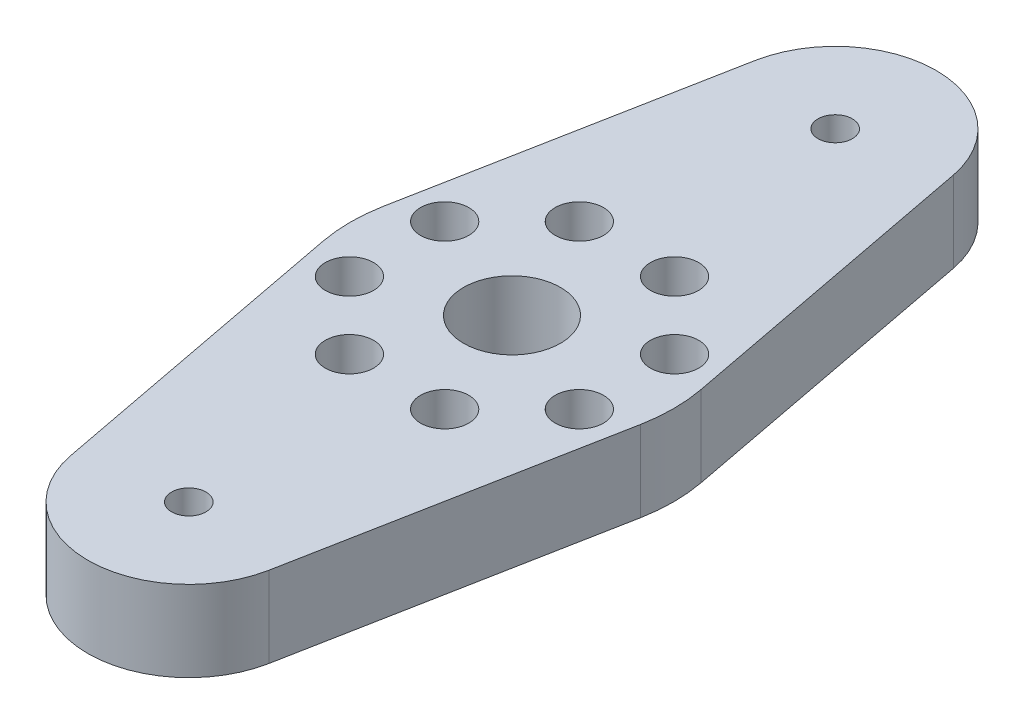
ISO-10303-21;
HEADER;
FILE_DESCRIPTION(('STEP AP214'),'2;1');
FILE_NAME('part.step','',(''),(''),'','','');
FILE_SCHEMA(('AUTOMOTIVE_DESIGN { 1 0 10303 214 1 1 1 1 }'));
ENDSEC;
DATA;
#1=APPLICATION_CONTEXT('core data for automotive mechanical design processes');
#2=APPLICATION_PROTOCOL_DEFINITION('international standard','automotive_design',2000,#1);
#3=PRODUCT_CONTEXT('',#1,'mechanical');
#4=PRODUCT('Part','Part','',(#3));
#5=PRODUCT_RELATED_PRODUCT_CATEGORY('part','',(#4));
#6=PRODUCT_DEFINITION_FORMATION('','',#4);
#7=PRODUCT_DEFINITION_CONTEXT('part definition',#1,'design');
#8=PRODUCT_DEFINITION('design','',#6,#7);
#9=PRODUCT_DEFINITION_SHAPE('','',#8);
#10=(LENGTH_UNIT() NAMED_UNIT(*) SI_UNIT(.MILLI.,.METRE.));
#11=(NAMED_UNIT(*) PLANE_ANGLE_UNIT() SI_UNIT($,.RADIAN.));
#12=(NAMED_UNIT(*) SI_UNIT($,.STERADIAN.) SOLID_ANGLE_UNIT());
#13=UNCERTAINTY_MEASURE_WITH_UNIT(LENGTH_MEASURE(1.E-05),#10,'distance_accuracy_value','');
#14=(GEOMETRIC_REPRESENTATION_CONTEXT(3) GLOBAL_UNCERTAINTY_ASSIGNED_CONTEXT((#13)) GLOBAL_UNIT_ASSIGNED_CONTEXT((#10,
#11,#12)) REPRESENTATION_CONTEXT('',''));
#15=CARTESIAN_POINT('',(0.,0.,0.));
#16=DIRECTION('',(0.,0.,1.));
#17=DIRECTION('',(1.,0.,0.));
#18=AXIS2_PLACEMENT_3D('',#15,#16,#17);
#19=CARTESIAN_POINT('',(0.,6.35,0.));
#20=DIRECTION('',(0.,1.,0.));
#21=DIRECTION('',(0.,0.,1.));
#22=AXIS2_PLACEMENT_3D('',#19,#20,#21);
#23=PLANE('',#22);
#24=CARTESIAN_POINT('',(-9.03461794842787,6.35,3.74226128509822));
#25=DIRECTION('',(0.,1.,0.));
#26=DIRECTION('',(0.,0.,1.));
#27=AXIS2_PLACEMENT_3D('',#24,#25,#26);
#28=CIRCLE('',#27,1.89865);
#29=CARTESIAN_POINT('',(-9.03461794842787,6.35,5.64091128509822));
#30=VERTEX_POINT('',#29);
#31=EDGE_CURVE('E254',#30,#30,#28,.T.);
#32=ORIENTED_EDGE('',*,*,#31,.F.);
#33=EDGE_LOOP('',(#32));
#34=FACE_BOUND('',#33,.T.);
#35=CARTESIAN_POINT('',(-9.0346179484279,6.35,-3.74226128509816));
#36=DIRECTION('',(0.,1.,0.));
#37=DIRECTION('',(0.,0.,1.));
#38=AXIS2_PLACEMENT_3D('',#35,#36,#37);
#39=CIRCLE('',#38,1.89865);
#40=CARTESIAN_POINT('',(-9.0346179484279,6.35,-1.84361128509816));
#41=VERTEX_POINT('',#40);
#42=EDGE_CURVE('E247',#41,#41,#39,.T.);
#43=ORIENTED_EDGE('',*,*,#42,.F.);
#44=EDGE_LOOP('',(#43));
#45=FACE_BOUND('',#44,.T.);
#46=CARTESIAN_POINT('',(9.03461794842787,6.35,-3.74226128509822));
#47=DIRECTION('',(0.,1.,0.));
#48=DIRECTION('',(0.,0.,1.));
#49=AXIS2_PLACEMENT_3D('',#46,#47,#48);
#50=CIRCLE('',#49,1.89865);
#51=CARTESIAN_POINT('',(9.03461794842787,6.35,-1.84361128509822));
#52=VERTEX_POINT('',#51);
#53=EDGE_CURVE('E237',#52,#52,#50,.T.);
#54=ORIENTED_EDGE('',*,*,#53,.F.);
#55=EDGE_LOOP('',(#54));
#56=FACE_BOUND('',#55,.T.);
#57=CARTESIAN_POINT('',(9.0346179484279,6.35,3.74226128509816));
#58=DIRECTION('',(0.,1.,0.));
#59=DIRECTION('',(0.,0.,1.));
#60=AXIS2_PLACEMENT_3D('',#57,#58,#59);
#61=CIRCLE('',#60,1.89865);
#62=CARTESIAN_POINT('',(9.0346179484279,6.35,5.64091128509816));
#63=VERTEX_POINT('',#62);
#64=EDGE_CURVE('E232',#63,#63,#61,.T.);
#65=ORIENTED_EDGE('',*,*,#64,.F.);
#66=EDGE_LOOP('',(#65));
#67=FACE_BOUND('',#66,.T.);
#68=CARTESIAN_POINT('',(-3.74226128509819,6.35,-9.03461794842788));
#69=DIRECTION('',(0.,1.,0.));
#70=DIRECTION('',(0.,0.,1.));
#71=AXIS2_PLACEMENT_3D('',#68,#69,#70);
#72=CIRCLE('',#71,1.89865);
#73=CARTESIAN_POINT('',(-3.74226128509819,6.35,-7.13596794842788));
#74=VERTEX_POINT('',#73);
#75=EDGE_CURVE('E225',#74,#74,#72,.T.);
#76=ORIENTED_EDGE('',*,*,#75,.F.);
#77=EDGE_LOOP('',(#76));
#78=FACE_BOUND('',#77,.T.);
#79=CARTESIAN_POINT('',(3.74226128509819,6.35,-9.03461794842788));
#80=DIRECTION('',(0.,1.,0.));
#81=DIRECTION('',(0.,0.,1.));
#82=AXIS2_PLACEMENT_3D('',#79,#80,#81);
#83=CIRCLE('',#82,1.89865);
#84=CARTESIAN_POINT('',(3.74226128509819,6.35,-7.13596794842788));
#85=VERTEX_POINT('',#84);
#86=EDGE_CURVE('E214',#85,#85,#83,.T.);
#87=ORIENTED_EDGE('',*,*,#86,.F.);
#88=EDGE_LOOP('',(#87));
#89=FACE_BOUND('',#88,.T.);
#90=CARTESIAN_POINT('',(3.74226128509819,6.35,9.03461794842788));
#91=DIRECTION('',(0.,1.,0.));
#92=DIRECTION('',(0.,0.,1.));
#93=AXIS2_PLACEMENT_3D('',#90,#91,#92);
#94=CIRCLE('',#93,1.89865);
#95=CARTESIAN_POINT('',(3.74226128509819,6.35,10.9332679484279));
#96=VERTEX_POINT('',#95);
#97=EDGE_CURVE('E206',#96,#96,#94,.T.);
#98=ORIENTED_EDGE('',*,*,#97,.F.);
#99=EDGE_LOOP('',(#98));
#100=FACE_BOUND('',#99,.T.);
#101=CARTESIAN_POINT('',(-3.74226128509819,6.35,9.03461794842788));
#102=DIRECTION('',(0.,1.,0.));
#103=DIRECTION('',(0.,0.,1.));
#104=AXIS2_PLACEMENT_3D('',#101,#102,#103);
#105=CIRCLE('',#104,1.89865);
#106=CARTESIAN_POINT('',(-3.74226128509819,6.35,10.9332679484279));
#107=VERTEX_POINT('',#106);
#108=EDGE_CURVE('E201',#107,#107,#105,.T.);
#109=ORIENTED_EDGE('',*,*,#108,.F.);
#110=EDGE_LOOP('',(#109));
#111=FACE_BOUND('',#110,.T.);
#112=CARTESIAN_POINT('',(0.,6.35,25.4));
#113=DIRECTION('',(0.,1.,0.));
#114=DIRECTION('',(0.,0.,1.));
#115=AXIS2_PLACEMENT_3D('',#112,#113,#114);
#116=CIRCLE('',#115,1.35254999999999);
#117=CARTESIAN_POINT('',(0.,6.35,26.75255));
#118=VERTEX_POINT('',#117);
#119=EDGE_CURVE('E190',#118,#118,#116,.T.);
#120=ORIENTED_EDGE('',*,*,#119,.F.);
#121=EDGE_LOOP('',(#120));
#122=FACE_BOUND('',#121,.T.);
#123=CARTESIAN_POINT('',(0.,6.35,-25.4));
#124=DIRECTION('',(0.,1.,0.));
#125=DIRECTION('',(0.,0.,1.));
#126=AXIS2_PLACEMENT_3D('',#123,#124,#125);
#127=CIRCLE('',#126,1.35254999999999);
#128=CARTESIAN_POINT('',(0.,6.35,-24.04745));
#129=VERTEX_POINT('',#128);
#130=EDGE_CURVE('E182',#129,#129,#127,.T.);
#131=ORIENTED_EDGE('',*,*,#130,.F.);
#132=EDGE_LOOP('',(#131));
#133=FACE_BOUND('',#132,.T.);
#134=CARTESIAN_POINT('',(0.,6.35,0.));
#135=DIRECTION('',(0.,1.,0.));
#136=DIRECTION('',(0.,0.,1.));
#137=AXIS2_PLACEMENT_3D('',#134,#135,#136);
#138=CIRCLE('',#137,12.7);
#139=CARTESIAN_POINT('',(-12.474760456117,6.35,-2.38124999999999));
#140=VERTEX_POINT('',#139);
#141=CARTESIAN_POINT('',(-12.474760456117,6.35,2.38125));
#142=VERTEX_POINT('',#141);
#143=EDGE_CURVE('E168',#140,#142,#138,.T.);
#144=ORIENTED_EDGE('',*,*,#143,.T.);
#145=DIRECTION('',(0.1875,0.,0.982264602843857));
#146=VECTOR('',#145,1.);
#147=CARTESIAN_POINT('',(-12.474760456117,6.35,2.38125));
#148=LINE('',#147,#146);
#149=CARTESIAN_POINT('',(-7.79672528507312,6.35,26.88828125));
#150=VERTEX_POINT('',#149);
#151=EDGE_CURVE('E102',#142,#150,#148,.T.);
#152=ORIENTED_EDGE('',*,*,#151,.T.);
#153=CARTESIAN_POINT('',(0.,6.35,25.4));
#154=DIRECTION('',(0.,1.,0.));
#155=DIRECTION('',(0.,0.,1.));
#156=AXIS2_PLACEMENT_3D('',#153,#154,#155);
#157=CIRCLE('',#156,7.9375);
#158=CARTESIAN_POINT('',(7.79672528507311,6.35,26.88828125));
#159=VERTEX_POINT('',#158);
#160=EDGE_CURVE('E157',#150,#159,#157,.T.);
#161=ORIENTED_EDGE('',*,*,#160,.T.);
#162=DIRECTION('',(0.1875,0.,-0.982264602843857));
#163=VECTOR('',#162,1.);
#164=CARTESIAN_POINT('',(12.474760456117,6.35,2.38125));
#165=LINE('',#164,#163);
#166=CARTESIAN_POINT('',(12.474760456117,6.35,2.38125));
#167=VERTEX_POINT('',#166);
#168=EDGE_CURVE('E153',#159,#167,#165,.T.);
#169=ORIENTED_EDGE('',*,*,#168,.T.);
#170=CARTESIAN_POINT('',(0.,6.35,0.));
#171=DIRECTION('',(0.,1.,0.));
#172=DIRECTION('',(0.,0.,1.));
#173=AXIS2_PLACEMENT_3D('',#170,#171,#172);
#174=CIRCLE('',#173,12.7);
#175=CARTESIAN_POINT('',(12.474760456117,6.35,-2.38125));
#176=VERTEX_POINT('',#175);
#177=EDGE_CURVE('E121',#167,#176,#174,.T.);
#178=ORIENTED_EDGE('',*,*,#177,.T.);
#179=DIRECTION('',(-0.1875,0.,-0.982264602843857));
#180=VECTOR('',#179,1.);
#181=CARTESIAN_POINT('',(7.7967252850731,6.35,-26.88828125));
#182=LINE('',#181,#180);
#183=CARTESIAN_POINT('',(7.79672528507311,6.35,-26.88828125));
#184=VERTEX_POINT('',#183);
#185=EDGE_CURVE('E115',#176,#184,#182,.T.);
#186=ORIENTED_EDGE('',*,*,#185,.T.);
#187=CARTESIAN_POINT('',(0.,6.35,-25.4));
#188=DIRECTION('',(0.,1.,0.));
#189=DIRECTION('',(0.,0.,1.));
#190=AXIS2_PLACEMENT_3D('',#187,#188,#189);
#191=CIRCLE('',#190,7.9375);
#192=CARTESIAN_POINT('',(-7.79672528507313,6.35,-26.88828125));
#193=VERTEX_POINT('',#192);
#194=EDGE_CURVE('E119',#184,#193,#191,.T.);
#195=ORIENTED_EDGE('',*,*,#194,.T.);
#196=DIRECTION('',(-0.187499999999999,0.,0.982264602843857));
#197=VECTOR('',#196,1.);
#198=CARTESIAN_POINT('',(-12.474760456117,6.35,-2.38124999999999));
#199=LINE('',#198,#197);
#200=EDGE_CURVE('E59',#193,#140,#199,.T.);
#201=ORIENTED_EDGE('',*,*,#200,.T.);
#202=EDGE_LOOP('',(#144,#152,#161,#169,#178,#186,#195,#201));
#203=FACE_BOUND('',#202,.T.);
#204=CARTESIAN_POINT('',(0.,6.35,0.));
#205=DIRECTION('',(0.,1.,0.));
#206=DIRECTION('',(0.,0.,1.));
#207=AXIS2_PLACEMENT_3D('',#204,#205,#206);
#208=CIRCLE('',#207,3.81);
#209=CARTESIAN_POINT('',(0.,6.35,3.81));
#210=VERTEX_POINT('',#209);
#211=EDGE_CURVE('E174',#210,#210,#208,.T.);
#212=ORIENTED_EDGE('',*,*,#211,.F.);
#213=EDGE_LOOP('',(#212));
#214=FACE_BOUND('',#213,.T.);
#215=ADVANCED_FACE('F40',(#34,#45,#56,#67,#78,#89,#100,#111,#122,#133,#203,#214),#23,.T.);
#216=CARTESIAN_POINT('',(0.,0.,0.));
#217=DIRECTION('',(0.,1.,0.));
#218=DIRECTION('',(0.,0.,1.));
#219=AXIS2_PLACEMENT_3D('',#216,#217,#218);
#220=PLANE('',#219);
#221=CARTESIAN_POINT('',(-9.03461794842787,0.,3.74226128509822));
#222=DIRECTION('',(0.,1.,0.));
#223=DIRECTION('',(0.,0.,1.));
#224=AXIS2_PLACEMENT_3D('',#221,#222,#223);
#225=CIRCLE('',#224,1.89865);
#226=CARTESIAN_POINT('',(-9.03461794842787,0.,5.64091128509822));
#227=VERTEX_POINT('',#226);
#228=EDGE_CURVE('E252',#227,#227,#225,.T.);
#229=ORIENTED_EDGE('',*,*,#228,.T.);
#230=EDGE_LOOP('',(#229));
#231=FACE_BOUND('',#230,.T.);
#232=CARTESIAN_POINT('',(-9.0346179484279,0.,-3.74226128509816));
#233=DIRECTION('',(0.,1.,0.));
#234=DIRECTION('',(0.,0.,1.));
#235=AXIS2_PLACEMENT_3D('',#232,#233,#234);
#236=CIRCLE('',#235,1.89865);
#237=CARTESIAN_POINT('',(-9.0346179484279,0.,-1.84361128509816));
#238=VERTEX_POINT('',#237);
#239=EDGE_CURVE('E242',#238,#238,#236,.T.);
#240=ORIENTED_EDGE('',*,*,#239,.T.);
#241=EDGE_LOOP('',(#240));
#242=FACE_BOUND('',#241,.T.);
#243=CARTESIAN_POINT('',(9.03461794842787,0.,-3.74226128509822));
#244=DIRECTION('',(0.,1.,0.));
#245=DIRECTION('',(0.,0.,1.));
#246=AXIS2_PLACEMENT_3D('',#243,#244,#245);
#247=CIRCLE('',#246,1.89865);
#248=CARTESIAN_POINT('',(9.03461794842787,0.,-1.84361128509822));
#249=VERTEX_POINT('',#248);
#250=EDGE_CURVE('E44',#249,#249,#247,.T.);
#251=ORIENTED_EDGE('',*,*,#250,.T.);
#252=EDGE_LOOP('',(#251));
#253=FACE_BOUND('',#252,.T.);
#254=CARTESIAN_POINT('',(9.0346179484279,0.,3.74226128509816));
#255=DIRECTION('',(0.,1.,0.));
#256=DIRECTION('',(0.,0.,1.));
#257=AXIS2_PLACEMENT_3D('',#254,#255,#256);
#258=CIRCLE('',#257,1.89865);
#259=CARTESIAN_POINT('',(9.0346179484279,0.,5.64091128509816));
#260=VERTEX_POINT('',#259);
#261=EDGE_CURVE('E230',#260,#260,#258,.T.);
#262=ORIENTED_EDGE('',*,*,#261,.T.);
#263=EDGE_LOOP('',(#262));
#264=FACE_BOUND('',#263,.T.);
#265=CARTESIAN_POINT('',(-3.74226128509819,0.,-9.03461794842788));
#266=DIRECTION('',(0.,1.,0.));
#267=DIRECTION('',(0.,0.,1.));
#268=AXIS2_PLACEMENT_3D('',#265,#266,#267);
#269=CIRCLE('',#268,1.89865);
#270=CARTESIAN_POINT('',(-3.74226128509819,0.,-7.13596794842788));
#271=VERTEX_POINT('',#270);
#272=EDGE_CURVE('E219',#271,#271,#269,.T.);
#273=ORIENTED_EDGE('',*,*,#272,.T.);
#274=EDGE_LOOP('',(#273));
#275=FACE_BOUND('',#274,.T.);
#276=CARTESIAN_POINT('',(3.74226128509819,0.,-9.03461794842788));
#277=DIRECTION('',(0.,1.,0.));
#278=DIRECTION('',(0.,0.,1.));
#279=AXIS2_PLACEMENT_3D('',#276,#277,#278);
#280=CIRCLE('',#279,1.89865);
#281=CARTESIAN_POINT('',(3.74226128509819,0.,-7.13596794842788));
#282=VERTEX_POINT('',#281);
#283=EDGE_CURVE('E211',#282,#282,#280,.T.);
#284=ORIENTED_EDGE('',*,*,#283,.T.);
#285=EDGE_LOOP('',(#284));
#286=FACE_BOUND('',#285,.T.);
#287=CARTESIAN_POINT('',(3.74226128509819,0.,9.03461794842788));
#288=DIRECTION('',(0.,1.,0.));
#289=DIRECTION('',(0.,0.,1.));
#290=AXIS2_PLACEMENT_3D('',#287,#288,#289);
#291=CIRCLE('',#290,1.89865);
#292=CARTESIAN_POINT('',(3.74226128509819,0.,10.9332679484279));
#293=VERTEX_POINT('',#292);
#294=EDGE_CURVE('E205',#293,#293,#291,.T.);
#295=ORIENTED_EDGE('',*,*,#294,.T.);
#296=EDGE_LOOP('',(#295));
#297=FACE_BOUND('',#296,.T.);
#298=CARTESIAN_POINT('',(-3.74226128509819,0.,9.03461794842788));
#299=DIRECTION('',(0.,1.,0.));
#300=DIRECTION('',(0.,0.,1.));
#301=AXIS2_PLACEMENT_3D('',#298,#299,#300);
#302=CIRCLE('',#301,1.89865);
#303=CARTESIAN_POINT('',(-3.74226128509819,0.,10.9332679484279));
#304=VERTEX_POINT('',#303);
#305=EDGE_CURVE('E195',#304,#304,#302,.T.);
#306=ORIENTED_EDGE('',*,*,#305,.T.);
#307=EDGE_LOOP('',(#306));
#308=FACE_BOUND('',#307,.T.);
#309=CARTESIAN_POINT('',(0.,0.,25.4));
#310=DIRECTION('',(0.,1.,0.));
#311=DIRECTION('',(0.,0.,1.));
#312=AXIS2_PLACEMENT_3D('',#309,#310,#311);
#313=CIRCLE('',#312,1.35254999999999);
#314=CARTESIAN_POINT('',(0.,0.,26.75255));
#315=VERTEX_POINT('',#314);
#316=EDGE_CURVE('E187',#315,#315,#313,.T.);
#317=ORIENTED_EDGE('',*,*,#316,.T.);
#318=EDGE_LOOP('',(#317));
#319=FACE_BOUND('',#318,.T.);
#320=CARTESIAN_POINT('',(0.,0.,-25.4));
#321=DIRECTION('',(0.,1.,0.));
#322=DIRECTION('',(0.,0.,1.));
#323=AXIS2_PLACEMENT_3D('',#320,#321,#322);
#324=CIRCLE('',#323,1.35254999999999);
#325=CARTESIAN_POINT('',(0.,0.,-24.04745));
#326=VERTEX_POINT('',#325);
#327=EDGE_CURVE('E175',#326,#326,#324,.T.);
#328=ORIENTED_EDGE('',*,*,#327,.T.);
#329=EDGE_LOOP('',(#328));
#330=FACE_BOUND('',#329,.T.);
#331=CARTESIAN_POINT('',(0.,0.,0.));
#332=DIRECTION('',(0.,1.,0.));
#333=DIRECTION('',(0.,0.,1.));
#334=AXIS2_PLACEMENT_3D('',#331,#332,#333);
#335=CIRCLE('',#334,12.7);
#336=CARTESIAN_POINT('',(-12.474760456117,0.,-2.38124999999999));
#337=VERTEX_POINT('',#336);
#338=CARTESIAN_POINT('',(-12.474760456117,0.,2.38125));
#339=VERTEX_POINT('',#338);
#340=EDGE_CURVE('E180',#337,#339,#335,.T.);
#341=ORIENTED_EDGE('',*,*,#340,.F.);
#342=DIRECTION('',(-0.187499999999999,0.,0.982264602843857));
#343=VECTOR('',#342,1.);
#344=CARTESIAN_POINT('',(-12.474760456117,0.,-2.38124999999999));
#345=LINE('',#344,#343);
#346=CARTESIAN_POINT('',(-7.79672528507313,0.,-26.88828125));
#347=VERTEX_POINT('',#346);
#348=EDGE_CURVE('E94',#347,#337,#345,.T.);
#349=ORIENTED_EDGE('',*,*,#348,.F.);
#350=CARTESIAN_POINT('',(0.,0.,-25.4));
#351=DIRECTION('',(0.,1.,0.));
#352=DIRECTION('',(0.,0.,1.));
#353=AXIS2_PLACEMENT_3D('',#350,#351,#352);
#354=CIRCLE('',#353,7.9375);
#355=CARTESIAN_POINT('',(7.79672528507311,0.,-26.88828125));
#356=VERTEX_POINT('',#355);
#357=EDGE_CURVE('E88',#356,#347,#354,.T.);
#358=ORIENTED_EDGE('',*,*,#357,.F.);
#359=DIRECTION('',(-0.1875,0.,-0.982264602843857));
#360=VECTOR('',#359,1.);
#361=CARTESIAN_POINT('',(7.7967252850731,0.,-26.88828125));
#362=LINE('',#361,#360);
#363=CARTESIAN_POINT('',(12.474760456117,0.,-2.38125));
#364=VERTEX_POINT('',#363);
#365=EDGE_CURVE('E130',#364,#356,#362,.T.);
#366=ORIENTED_EDGE('',*,*,#365,.F.);
#367=CARTESIAN_POINT('',(0.,0.,0.));
#368=DIRECTION('',(0.,1.,0.));
#369=DIRECTION('',(0.,0.,1.));
#370=AXIS2_PLACEMENT_3D('',#367,#368,#369);
#371=CIRCLE('',#370,12.7);
#372=CARTESIAN_POINT('',(12.474760456117,0.,2.38125));
#373=VERTEX_POINT('',#372);
#374=EDGE_CURVE('E349',#373,#364,#371,.T.);
#375=ORIENTED_EDGE('',*,*,#374,.F.);
#376=DIRECTION('',(0.1875,0.,-0.982264602843857));
#377=VECTOR('',#376,1.);
#378=CARTESIAN_POINT('',(12.474760456117,0.,2.38125));
#379=LINE('',#378,#377);
#380=CARTESIAN_POINT('',(7.79672528507311,0.,26.88828125));
#381=VERTEX_POINT('',#380);
#382=EDGE_CURVE('E347',#381,#373,#379,.T.);
#383=ORIENTED_EDGE('',*,*,#382,.F.);
#384=CARTESIAN_POINT('',(0.,0.,25.4));
#385=DIRECTION('',(0.,1.,0.));
#386=DIRECTION('',(0.,0.,1.));
#387=AXIS2_PLACEMENT_3D('',#384,#385,#386);
#388=CIRCLE('',#387,7.9375);
#389=CARTESIAN_POINT('',(-7.79672528507312,0.,26.88828125));
#390=VERTEX_POINT('',#389);
#391=EDGE_CURVE('E338',#390,#381,#388,.T.);
#392=ORIENTED_EDGE('',*,*,#391,.F.);
#393=DIRECTION('',(0.1875,0.,0.982264602843857));
#394=VECTOR('',#393,1.);
#395=CARTESIAN_POINT('',(-12.474760456117,0.,2.38125));
#396=LINE('',#395,#394);
#397=EDGE_CURVE('E330',#339,#390,#396,.T.);
#398=ORIENTED_EDGE('',*,*,#397,.F.);
#399=EDGE_LOOP('',(#341,#349,#358,#366,#375,#383,#392,#398));
#400=FACE_BOUND('',#399,.T.);
#401=CARTESIAN_POINT('',(0.,0.,0.));
#402=DIRECTION('',(0.,1.,0.));
#403=DIRECTION('',(0.,0.,1.));
#404=AXIS2_PLACEMENT_3D('',#401,#402,#403);
#405=CIRCLE('',#404,3.81);
#406=CARTESIAN_POINT('',(0.,0.,3.81));
#407=VERTEX_POINT('',#406);
#408=EDGE_CURVE('E172',#407,#407,#405,.T.);
#409=ORIENTED_EDGE('',*,*,#408,.T.);
#410=EDGE_LOOP('',(#409));
#411=FACE_BOUND('',#410,.T.);
#412=ADVANCED_FACE('F265',(#231,#242,#253,#264,#275,#286,#297,#308,#319,#330,#400,#411),#220,.F.);
#413=CARTESIAN_POINT('',(0.,6.35,0.));
#414=DIRECTION('',(0.,-1.,0.));
#415=DIRECTION('',(0.,0.,-1.));
#416=AXIS2_PLACEMENT_3D('',#413,#414,#415);
#417=CYLINDRICAL_SURFACE('',#416,12.7);
#418=ORIENTED_EDGE('',*,*,#340,.T.);
#419=DIRECTION('',(0.,-1.,0.));
#420=VECTOR('',#419,1.);
#421=CARTESIAN_POINT('',(-12.474760456117,6.35,2.38125));
#422=LINE('',#421,#420);
#423=EDGE_CURVE('E12',#142,#339,#422,.T.);
#424=ORIENTED_EDGE('',*,*,#423,.F.);
#425=ORIENTED_EDGE('',*,*,#143,.F.);
#426=DIRECTION('',(0.,-1.,0.));
#427=VECTOR('',#426,1.);
#428=CARTESIAN_POINT('',(-12.474760456117,6.35,-2.38124999999999));
#429=LINE('',#428,#427);
#430=EDGE_CURVE('E138',#140,#337,#429,.T.);
#431=ORIENTED_EDGE('',*,*,#430,.T.);
#432=EDGE_LOOP('',(#418,#424,#425,#431));
#433=FACE_BOUND('',#432,.T.);
#434=ADVANCED_FACE('F42',(#433),#417,.T.);
#435=CARTESIAN_POINT('',(-12.474760456117,6.35,2.38125));
#436=DIRECTION('',(0.982264602843857,0.,-0.1875));
#437=DIRECTION('',(-0.1875,0.,-0.982264602843857));
#438=AXIS2_PLACEMENT_3D('',#435,#436,#437);
#439=PLANE('',#438);
#440=ORIENTED_EDGE('',*,*,#397,.T.);
#441=DIRECTION('',(0.,-1.,0.));
#442=VECTOR('',#441,1.);
#443=CARTESIAN_POINT('',(-7.79672528507312,6.35,26.88828125));
#444=LINE('',#443,#442);
#445=EDGE_CURVE('E50',#150,#390,#444,.T.);
#446=ORIENTED_EDGE('',*,*,#445,.F.);
#447=ORIENTED_EDGE('',*,*,#151,.F.);
#448=ORIENTED_EDGE('',*,*,#423,.T.);
#449=EDGE_LOOP('',(#440,#446,#447,#448));
#450=FACE_BOUND('',#449,.T.);
#451=ADVANCED_FACE('F323',(#450),#439,.F.);
#452=CARTESIAN_POINT('',(0.,6.35,25.4));
#453=DIRECTION('',(0.,-1.,0.));
#454=DIRECTION('',(0.,0.,-1.));
#455=AXIS2_PLACEMENT_3D('',#452,#453,#454);
#456=CYLINDRICAL_SURFACE('',#455,7.9375);
#457=ORIENTED_EDGE('',*,*,#391,.T.);
#458=DIRECTION('',(0.,-1.,0.));
#459=VECTOR('',#458,1.);
#460=CARTESIAN_POINT('',(7.79672528507311,6.35,26.88828125));
#461=LINE('',#460,#459);
#462=EDGE_CURVE('E342',#159,#381,#461,.T.);
#463=ORIENTED_EDGE('',*,*,#462,.F.);
#464=ORIENTED_EDGE('',*,*,#160,.F.);
#465=ORIENTED_EDGE('',*,*,#445,.T.);
#466=EDGE_LOOP('',(#457,#463,#464,#465));
#467=FACE_BOUND('',#466,.T.);
#468=ADVANCED_FACE('F320',(#467),#456,.T.);
#469=CARTESIAN_POINT('',(12.474760456117,6.35,2.38125));
#470=DIRECTION('',(-0.982264602843857,0.,-0.1875));
#471=DIRECTION('',(-0.1875,0.,0.982264602843857));
#472=AXIS2_PLACEMENT_3D('',#469,#470,#471);
#473=PLANE('',#472);
#474=ORIENTED_EDGE('',*,*,#382,.T.);
#475=DIRECTION('',(0.,-1.,0.));
#476=VECTOR('',#475,1.);
#477=CARTESIAN_POINT('',(12.474760456117,6.35,2.38125));
#478=LINE('',#477,#476);
#479=EDGE_CURVE('E359',#167,#373,#478,.T.);
#480=ORIENTED_EDGE('',*,*,#479,.F.);
#481=ORIENTED_EDGE('',*,*,#168,.F.);
#482=ORIENTED_EDGE('',*,*,#462,.T.);
#483=EDGE_LOOP('',(#474,#480,#481,#482));
#484=FACE_BOUND('',#483,.T.);
#485=ADVANCED_FACE('F316',(#484),#473,.F.);
#486=CARTESIAN_POINT('',(0.,6.35,0.));
#487=DIRECTION('',(0.,-1.,0.));
#488=DIRECTION('',(0.,0.,-1.));
#489=AXIS2_PLACEMENT_3D('',#486,#487,#488);
#490=CYLINDRICAL_SURFACE('',#489,12.7);
#491=ORIENTED_EDGE('',*,*,#374,.T.);
#492=DIRECTION('',(0.,-1.,0.));
#493=VECTOR('',#492,1.);
#494=CARTESIAN_POINT('',(12.474760456117,6.35,-2.38125));
#495=LINE('',#494,#493);
#496=EDGE_CURVE('E131',#176,#364,#495,.T.);
#497=ORIENTED_EDGE('',*,*,#496,.F.);
#498=ORIENTED_EDGE('',*,*,#177,.F.);
#499=ORIENTED_EDGE('',*,*,#479,.T.);
#500=EDGE_LOOP('',(#491,#497,#498,#499));
#501=FACE_BOUND('',#500,.T.);
#502=ADVANCED_FACE('F313',(#501),#490,.T.);
#503=CARTESIAN_POINT('',(7.7967252850731,6.35,-26.88828125));
#504=DIRECTION('',(-0.982264602843857,0.,0.1875));
#505=DIRECTION('',(0.1875,0.,0.982264602843857));
#506=AXIS2_PLACEMENT_3D('',#503,#504,#505);
#507=PLANE('',#506);
#508=ORIENTED_EDGE('',*,*,#365,.T.);
#509=DIRECTION('',(0.,-1.,0.));
#510=VECTOR('',#509,1.);
#511=CARTESIAN_POINT('',(7.79672528507311,6.35,-26.88828125));
#512=LINE('',#511,#510);
#513=EDGE_CURVE('E127',#184,#356,#512,.T.);
#514=ORIENTED_EDGE('',*,*,#513,.F.);
#515=ORIENTED_EDGE('',*,*,#185,.F.);
#516=ORIENTED_EDGE('',*,*,#496,.T.);
#517=EDGE_LOOP('',(#508,#514,#515,#516));
#518=FACE_BOUND('',#517,.T.);
#519=ADVANCED_FACE('F128',(#518),#507,.F.);
#520=CARTESIAN_POINT('',(0.,6.35,-25.4));
#521=DIRECTION('',(0.,-1.,0.));
#522=DIRECTION('',(0.,0.,-1.));
#523=AXIS2_PLACEMENT_3D('',#520,#521,#522);
#524=CYLINDRICAL_SURFACE('',#523,7.9375);
#525=ORIENTED_EDGE('',*,*,#357,.T.);
#526=DIRECTION('',(0.,-1.,0.));
#527=VECTOR('',#526,1.);
#528=CARTESIAN_POINT('',(-7.79672528507313,6.35,-26.88828125));
#529=LINE('',#528,#527);
#530=EDGE_CURVE('E132',#193,#347,#529,.T.);
#531=ORIENTED_EDGE('',*,*,#530,.F.);
#532=ORIENTED_EDGE('',*,*,#194,.F.);
#533=ORIENTED_EDGE('',*,*,#513,.T.);
#534=EDGE_LOOP('',(#525,#531,#532,#533));
#535=FACE_BOUND('',#534,.T.);
#536=ADVANCED_FACE('F134',(#535),#524,.T.);
#537=CARTESIAN_POINT('',(-12.474760456117,6.35,-2.38124999999999));
#538=DIRECTION('',(0.982264602843857,0.,0.187499999999999));
#539=DIRECTION('',(0.187499999999999,0.,-0.982264602843857));
#540=AXIS2_PLACEMENT_3D('',#537,#538,#539);
#541=PLANE('',#540);
#542=ORIENTED_EDGE('',*,*,#348,.T.);
#543=ORIENTED_EDGE('',*,*,#430,.F.);
#544=ORIENTED_EDGE('',*,*,#200,.F.);
#545=ORIENTED_EDGE('',*,*,#530,.T.);
#546=EDGE_LOOP('',(#542,#543,#544,#545));
#547=FACE_BOUND('',#546,.T.);
#548=ADVANCED_FACE('F298',(#547),#541,.F.);
#549=CARTESIAN_POINT('',(0.,6.35,0.));
#550=DIRECTION('',(0.,-1.,0.));
#551=DIRECTION('',(0.,0.,-1.));
#552=AXIS2_PLACEMENT_3D('',#549,#550,#551);
#553=CYLINDRICAL_SURFACE('',#552,3.81);
#554=ORIENTED_EDGE('',*,*,#211,.T.);
#555=EDGE_LOOP('',(#554));
#556=FACE_BOUND('',#555,.T.);
#557=ORIENTED_EDGE('',*,*,#408,.F.);
#558=EDGE_LOOP('',(#557));
#559=FACE_BOUND('',#558,.T.);
#560=ADVANCED_FACE('F288',(#556,#559),#553,.F.);
#561=CARTESIAN_POINT('',(0.,6.35,-25.4));
#562=DIRECTION('',(0.,1.,0.));
#563=DIRECTION('',(0.,0.,1.));
#564=AXIS2_PLACEMENT_3D('',#561,#562,#563);
#565=CYLINDRICAL_SURFACE('',#564,1.35254999999999);
#566=ORIENTED_EDGE('',*,*,#327,.F.);
#567=EDGE_LOOP('',(#566));
#568=FACE_BOUND('',#567,.T.);
#569=ORIENTED_EDGE('',*,*,#130,.T.);
#570=EDGE_LOOP('',(#569));
#571=FACE_BOUND('',#570,.T.);
#572=ADVANCED_FACE('F285',(#568,#571),#565,.F.);
#573=CARTESIAN_POINT('',(0.,6.35,25.4));
#574=DIRECTION('',(0.,1.,0.));
#575=DIRECTION('',(0.,0.,1.));
#576=AXIS2_PLACEMENT_3D('',#573,#574,#575);
#577=CYLINDRICAL_SURFACE('',#576,1.35254999999999);
#578=ORIENTED_EDGE('',*,*,#316,.F.);
#579=EDGE_LOOP('',(#578));
#580=FACE_BOUND('',#579,.T.);
#581=ORIENTED_EDGE('',*,*,#119,.T.);
#582=EDGE_LOOP('',(#581));
#583=FACE_BOUND('',#582,.T.);
#584=ADVANCED_FACE('F287',(#580,#583),#577,.F.);
#585=CARTESIAN_POINT('',(-3.74226128509819,6.35,9.03461794842788));
#586=DIRECTION('',(0.,1.,0.));
#587=DIRECTION('',(0.,0.,1.));
#588=AXIS2_PLACEMENT_3D('',#585,#586,#587);
#589=CYLINDRICAL_SURFACE('',#588,1.89865);
#590=ORIENTED_EDGE('',*,*,#108,.T.);
#591=EDGE_LOOP('',(#590));
#592=FACE_BOUND('',#591,.T.);
#593=ORIENTED_EDGE('',*,*,#305,.F.);
#594=EDGE_LOOP('',(#593));
#595=FACE_BOUND('',#594,.T.);
#596=ADVANCED_FACE('F295',(#592,#595),#589,.F.);
#597=CARTESIAN_POINT('',(3.74226128509819,6.35,9.03461794842788));
#598=DIRECTION('',(0.,1.,0.));
#599=DIRECTION('',(0.,0.,1.));
#600=AXIS2_PLACEMENT_3D('',#597,#598,#599);
#601=CYLINDRICAL_SURFACE('',#600,1.89865);
#602=ORIENTED_EDGE('',*,*,#97,.T.);
#603=EDGE_LOOP('',(#602));
#604=FACE_BOUND('',#603,.T.);
#605=ORIENTED_EDGE('',*,*,#294,.F.);
#606=EDGE_LOOP('',(#605));
#607=FACE_BOUND('',#606,.T.);
#608=ADVANCED_FACE('F367',(#604,#607),#601,.F.);
#609=CARTESIAN_POINT('',(3.74226128509819,6.35,-9.03461794842788));
#610=DIRECTION('',(0.,1.,0.));
#611=DIRECTION('',(0.,0.,1.));
#612=AXIS2_PLACEMENT_3D('',#609,#610,#611);
#613=CYLINDRICAL_SURFACE('',#612,1.89865);
#614=ORIENTED_EDGE('',*,*,#86,.T.);
#615=EDGE_LOOP('',(#614));
#616=FACE_BOUND('',#615,.T.);
#617=ORIENTED_EDGE('',*,*,#283,.F.);
#618=EDGE_LOOP('',(#617));
#619=FACE_BOUND('',#618,.T.);
#620=ADVANCED_FACE('F369',(#616,#619),#613,.F.);
#621=CARTESIAN_POINT('',(-3.74226128509819,6.35,-9.03461794842788));
#622=DIRECTION('',(0.,1.,0.));
#623=DIRECTION('',(0.,0.,1.));
#624=AXIS2_PLACEMENT_3D('',#621,#622,#623);
#625=CYLINDRICAL_SURFACE('',#624,1.89865);
#626=ORIENTED_EDGE('',*,*,#75,.T.);
#627=EDGE_LOOP('',(#626));
#628=FACE_BOUND('',#627,.T.);
#629=ORIENTED_EDGE('',*,*,#272,.F.);
#630=EDGE_LOOP('',(#629));
#631=FACE_BOUND('',#630,.T.);
#632=ADVANCED_FACE('F376',(#628,#631),#625,.F.);
#633=CARTESIAN_POINT('',(9.0346179484279,6.35,3.74226128509816));
#634=DIRECTION('',(0.,1.,0.));
#635=DIRECTION('',(0.,0.,1.));
#636=AXIS2_PLACEMENT_3D('',#633,#634,#635);
#637=CYLINDRICAL_SURFACE('',#636,1.89865);
#638=ORIENTED_EDGE('',*,*,#64,.T.);
#639=EDGE_LOOP('',(#638));
#640=FACE_BOUND('',#639,.T.);
#641=ORIENTED_EDGE('',*,*,#261,.F.);
#642=EDGE_LOOP('',(#641));
#643=FACE_BOUND('',#642,.T.);
#644=ADVANCED_FACE('F383',(#640,#643),#637,.F.);
#645=CARTESIAN_POINT('',(9.03461794842787,6.35,-3.74226128509822));
#646=DIRECTION('',(0.,1.,0.));
#647=DIRECTION('',(0.,0.,1.));
#648=AXIS2_PLACEMENT_3D('',#645,#646,#647);
#649=CYLINDRICAL_SURFACE('',#648,1.89865);
#650=ORIENTED_EDGE('',*,*,#53,.T.);
#651=EDGE_LOOP('',(#650));
#652=FACE_BOUND('',#651,.T.);
#653=ORIENTED_EDGE('',*,*,#250,.F.);
#654=EDGE_LOOP('',(#653));
#655=FACE_BOUND('',#654,.T.);
#656=ADVANCED_FACE('F387',(#652,#655),#649,.F.);
#657=CARTESIAN_POINT('',(-9.0346179484279,6.35,-3.74226128509816));
#658=DIRECTION('',(0.,1.,0.));
#659=DIRECTION('',(0.,0.,1.));
#660=AXIS2_PLACEMENT_3D('',#657,#658,#659);
#661=CYLINDRICAL_SURFACE('',#660,1.89865);
#662=ORIENTED_EDGE('',*,*,#42,.T.);
#663=EDGE_LOOP('',(#662));
#664=FACE_BOUND('',#663,.T.);
#665=ORIENTED_EDGE('',*,*,#239,.F.);
#666=EDGE_LOOP('',(#665));
#667=FACE_BOUND('',#666,.T.);
#668=ADVANCED_FACE('F391',(#664,#667),#661,.F.);
#669=CARTESIAN_POINT('',(-9.03461794842787,6.35,3.74226128509822));
#670=DIRECTION('',(0.,1.,0.));
#671=DIRECTION('',(0.,0.,1.));
#672=AXIS2_PLACEMENT_3D('',#669,#670,#671);
#673=CYLINDRICAL_SURFACE('',#672,1.89865);
#674=ORIENTED_EDGE('',*,*,#31,.T.);
#675=EDGE_LOOP('',(#674));
#676=FACE_BOUND('',#675,.T.);
#677=ORIENTED_EDGE('',*,*,#228,.F.);
#678=EDGE_LOOP('',(#677));
#679=FACE_BOUND('',#678,.T.);
#680=ADVANCED_FACE('F260',(#676,#679),#673,.F.);
#681=CLOSED_SHELL('',(#215,#412,#434,#451,#468,#485,#502,#519,#536,#548,#560,#572,#584,#596,
#608,#620,#632,#644,#656,#668,#680));
#682=MANIFOLD_SOLID_BREP('B2',#681);
#683=ADVANCED_BREP_SHAPE_REPRESENTATION('',(#18,#682),#14);
#684=SHAPE_DEFINITION_REPRESENTATION(#9,#683);
ENDSEC;
END-ISO-10303-21;
